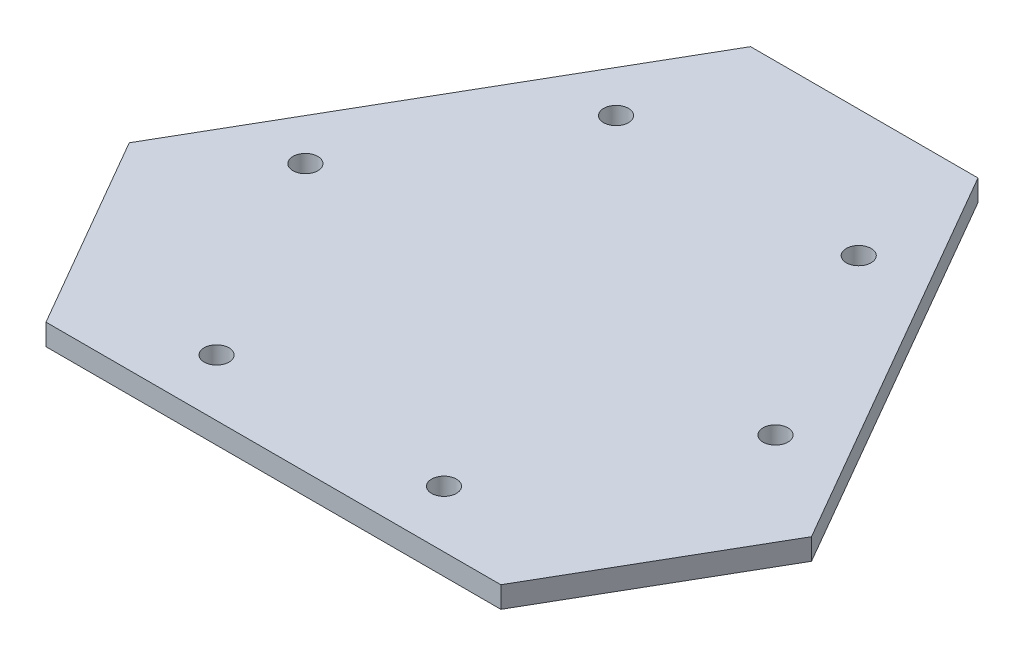
ISO-10303-21;
HEADER;
FILE_DESCRIPTION(('STEP AP214'),'2;1');
FILE_NAME('part.step','',(''),(''),'','','');
FILE_SCHEMA(('AUTOMOTIVE_DESIGN { 1 0 10303 214 1 1 1 1 }'));
ENDSEC;
DATA;
#1=APPLICATION_CONTEXT('core data for automotive mechanical design processes');
#2=APPLICATION_PROTOCOL_DEFINITION('international standard','automotive_design',2000,#1);
#3=PRODUCT_CONTEXT('',#1,'mechanical');
#4=PRODUCT('Part','Part','',(#3));
#5=PRODUCT_RELATED_PRODUCT_CATEGORY('part','',(#4));
#6=PRODUCT_DEFINITION_FORMATION('','',#4);
#7=PRODUCT_DEFINITION_CONTEXT('part definition',#1,'design');
#8=PRODUCT_DEFINITION('design','',#6,#7);
#9=PRODUCT_DEFINITION_SHAPE('','',#8);
#10=(LENGTH_UNIT() NAMED_UNIT(*) SI_UNIT(.MILLI.,.METRE.));
#11=(NAMED_UNIT(*) PLANE_ANGLE_UNIT() SI_UNIT($,.RADIAN.));
#12=(NAMED_UNIT(*) SI_UNIT($,.STERADIAN.) SOLID_ANGLE_UNIT());
#13=UNCERTAINTY_MEASURE_WITH_UNIT(LENGTH_MEASURE(1.E-05),#10,'distance_accuracy_value','');
#14=(GEOMETRIC_REPRESENTATION_CONTEXT(3) GLOBAL_UNCERTAINTY_ASSIGNED_CONTEXT((#13)) GLOBAL_UNIT_ASSIGNED_CONTEXT((#10,
#11,#12)) REPRESENTATION_CONTEXT('',''));
#15=CARTESIAN_POINT('',(0.,0.,0.));
#16=DIRECTION('',(0.,0.,1.));
#17=DIRECTION('',(1.,0.,0.));
#18=AXIS2_PLACEMENT_3D('',#15,#16,#17);
#19=CARTESIAN_POINT('',(-152.4,4.7625,29.329393674833));
#20=DIRECTION('',(0.866025403784438,0.,0.5));
#21=DIRECTION('',(0.5,0.,-0.866025403784439));
#22=AXIS2_PLACEMENT_3D('',#19,#20,#21);
#23=PLANE('',#22);
#24=DIRECTION('',(-0.5,0.,0.866025403784438));
#25=VECTOR('',#24,1.);
#26=CARTESIAN_POINT('',(-152.4,-4.7625,29.329393674833));
#27=LINE('',#26,#25);
#28=CARTESIAN_POINT('',(-50.7999999999999,-4.7625,-146.646968374165));
#29=VERTEX_POINT('',#28);
#30=CARTESIAN_POINT('',(-152.4,-4.7625,29.329393674833));
#31=VERTEX_POINT('',#30);
#32=EDGE_CURVE('E115',#29,#31,#27,.T.);
#33=ORIENTED_EDGE('',*,*,#32,.T.);
#34=DIRECTION('',(0.,-1.,0.));
#35=VECTOR('',#34,1.);
#36=CARTESIAN_POINT('',(-152.4,4.7625,29.329393674833));
#37=LINE('',#36,#35);
#38=CARTESIAN_POINT('',(-152.4,4.7625,29.329393674833));
#39=VERTEX_POINT('',#38);
#40=EDGE_CURVE('E11',#39,#31,#37,.T.);
#41=ORIENTED_EDGE('',*,*,#40,.F.);
#42=DIRECTION('',(-0.5,0.,0.866025403784438));
#43=VECTOR('',#42,1.);
#44=CARTESIAN_POINT('',(-152.4,4.7625,29.329393674833));
#45=LINE('',#44,#43);
#46=CARTESIAN_POINT('',(-50.7999999999999,4.7625,-146.646968374165));
#47=VERTEX_POINT('',#46);
#48=EDGE_CURVE('E126',#47,#39,#45,.T.);
#49=ORIENTED_EDGE('',*,*,#48,.F.);
#50=DIRECTION('',(0.,-1.,0.));
#51=VECTOR('',#50,1.);
#52=CARTESIAN_POINT('',(-50.7999999999999,4.7625,-146.646968374165));
#53=LINE('',#52,#51);
#54=EDGE_CURVE('E111',#47,#29,#53,.T.);
#55=ORIENTED_EDGE('',*,*,#54,.T.);
#56=EDGE_LOOP('',(#33,#41,#49,#55));
#57=FACE_BOUND('',#56,.T.);
#58=ADVANCED_FACE('F31',(#57),#23,.F.);
#59=CARTESIAN_POINT('',(-101.6,4.7625,117.317574699332));
#60=DIRECTION('',(0.866025403784439,0.,-0.5));
#61=DIRECTION('',(-0.5,0.,-0.866025403784439));
#62=AXIS2_PLACEMENT_3D('',#59,#60,#61);
#63=PLANE('',#62);
#64=DIRECTION('',(0.5,0.,0.866025403784439));
#65=VECTOR('',#64,1.);
#66=CARTESIAN_POINT('',(-101.6,-4.7625,117.317574699332));
#67=LINE('',#66,#65);
#68=CARTESIAN_POINT('',(-101.6,-4.7625,117.317574699332));
#69=VERTEX_POINT('',#68);
#70=EDGE_CURVE('E118',#31,#69,#67,.T.);
#71=ORIENTED_EDGE('',*,*,#70,.T.);
#72=DIRECTION('',(0.,-1.,0.));
#73=VECTOR('',#72,1.);
#74=CARTESIAN_POINT('',(-101.6,4.7625,117.317574699332));
#75=LINE('',#74,#73);
#76=CARTESIAN_POINT('',(-101.6,4.7625,117.317574699332));
#77=VERTEX_POINT('',#76);
#78=EDGE_CURVE('E39',#77,#69,#75,.T.);
#79=ORIENTED_EDGE('',*,*,#78,.F.);
#80=DIRECTION('',(0.5,0.,0.866025403784439));
#81=VECTOR('',#80,1.);
#82=CARTESIAN_POINT('',(-101.6,4.7625,117.317574699332));
#83=LINE('',#82,#81);
#84=EDGE_CURVE('E84',#39,#77,#83,.T.);
#85=ORIENTED_EDGE('',*,*,#84,.F.);
#86=ORIENTED_EDGE('',*,*,#40,.T.);
#87=EDGE_LOOP('',(#71,#79,#85,#86));
#88=FACE_BOUND('',#87,.T.);
#89=ADVANCED_FACE('F151',(#88),#63,.F.);
#90=CARTESIAN_POINT('',(101.6,4.7625,117.317574699332));
#91=DIRECTION('',(0.,0.,-1.));
#92=DIRECTION('',(-1.,0.,0.));
#93=AXIS2_PLACEMENT_3D('',#90,#91,#92);
#94=PLANE('',#93);
#95=DIRECTION('',(1.,0.,0.));
#96=VECTOR('',#95,1.);
#97=CARTESIAN_POINT('',(101.6,-4.7625,117.317574699332));
#98=LINE('',#97,#96);
#99=CARTESIAN_POINT('',(101.6,-4.7625,117.317574699332));
#100=VERTEX_POINT('',#99);
#101=EDGE_CURVE('E121',#69,#100,#98,.T.);
#102=ORIENTED_EDGE('',*,*,#101,.T.);
#103=DIRECTION('',(0.,-1.,0.));
#104=VECTOR('',#103,1.);
#105=CARTESIAN_POINT('',(101.6,4.7625,117.317574699332));
#106=LINE('',#105,#104);
#107=CARTESIAN_POINT('',(101.6,4.7625,117.317574699332));
#108=VERTEX_POINT('',#107);
#109=EDGE_CURVE('E106',#108,#100,#106,.T.);
#110=ORIENTED_EDGE('',*,*,#109,.F.);
#111=DIRECTION('',(1.,0.,0.));
#112=VECTOR('',#111,1.);
#113=CARTESIAN_POINT('',(101.6,4.7625,117.317574699332));
#114=LINE('',#113,#112);
#115=EDGE_CURVE('E97',#77,#108,#114,.T.);
#116=ORIENTED_EDGE('',*,*,#115,.F.);
#117=ORIENTED_EDGE('',*,*,#78,.T.);
#118=EDGE_LOOP('',(#102,#110,#116,#117));
#119=FACE_BOUND('',#118,.T.);
#120=ADVANCED_FACE('F132',(#119),#94,.F.);
#121=CARTESIAN_POINT('',(152.4,4.7625,29.329393674833));
#122=DIRECTION('',(-0.866025403784438,0.,-0.5));
#123=DIRECTION('',(-0.5,0.,0.866025403784438));
#124=AXIS2_PLACEMENT_3D('',#121,#122,#123);
#125=PLANE('',#124);
#126=DIRECTION('',(0.5,0.,-0.866025403784438));
#127=VECTOR('',#126,1.);
#128=CARTESIAN_POINT('',(152.4,-4.7625,29.329393674833));
#129=LINE('',#128,#127);
#130=CARTESIAN_POINT('',(152.4,-4.7625,29.329393674833));
#131=VERTEX_POINT('',#130);
#132=EDGE_CURVE('E105',#100,#131,#129,.T.);
#133=ORIENTED_EDGE('',*,*,#132,.T.);
#134=DIRECTION('',(0.,-1.,0.));
#135=VECTOR('',#134,1.);
#136=CARTESIAN_POINT('',(152.4,4.7625,29.329393674833));
#137=LINE('',#136,#135);
#138=CARTESIAN_POINT('',(152.4,4.7625,29.329393674833));
#139=VERTEX_POINT('',#138);
#140=EDGE_CURVE('E102',#139,#131,#137,.T.);
#141=ORIENTED_EDGE('',*,*,#140,.F.);
#142=DIRECTION('',(0.5,0.,-0.866025403784438));
#143=VECTOR('',#142,1.);
#144=CARTESIAN_POINT('',(152.4,4.7625,29.329393674833));
#145=LINE('',#144,#143);
#146=EDGE_CURVE('E91',#108,#139,#145,.T.);
#147=ORIENTED_EDGE('',*,*,#146,.F.);
#148=ORIENTED_EDGE('',*,*,#109,.T.);
#149=EDGE_LOOP('',(#133,#141,#147,#148));
#150=FACE_BOUND('',#149,.T.);
#151=ADVANCED_FACE('F103',(#150),#125,.F.);
#152=CARTESIAN_POINT('',(50.8000000000001,4.7625,-146.646968374165));
#153=DIRECTION('',(-0.866025403784439,0.,0.5));
#154=DIRECTION('',(0.5,0.,0.866025403784439));
#155=AXIS2_PLACEMENT_3D('',#152,#153,#154);
#156=PLANE('',#155);
#157=DIRECTION('',(-0.5,0.,-0.866025403784439));
#158=VECTOR('',#157,1.);
#159=CARTESIAN_POINT('',(50.8000000000001,-4.7625,-146.646968374165));
#160=LINE('',#159,#158);
#161=CARTESIAN_POINT('',(50.8000000000001,-4.7625,-146.646968374165));
#162=VERTEX_POINT('',#161);
#163=EDGE_CURVE('E70',#131,#162,#160,.T.);
#164=ORIENTED_EDGE('',*,*,#163,.T.);
#165=DIRECTION('',(0.,-1.,0.));
#166=VECTOR('',#165,1.);
#167=CARTESIAN_POINT('',(50.8000000000001,4.7625,-146.646968374165));
#168=LINE('',#167,#166);
#169=CARTESIAN_POINT('',(50.8000000000001,4.7625,-146.646968374165));
#170=VERTEX_POINT('',#169);
#171=EDGE_CURVE('E107',#170,#162,#168,.T.);
#172=ORIENTED_EDGE('',*,*,#171,.F.);
#173=DIRECTION('',(-0.5,0.,-0.866025403784439));
#174=VECTOR('',#173,1.);
#175=CARTESIAN_POINT('',(50.8000000000001,4.7625,-146.646968374165));
#176=LINE('',#175,#174);
#177=EDGE_CURVE('E95',#139,#170,#176,.T.);
#178=ORIENTED_EDGE('',*,*,#177,.F.);
#179=ORIENTED_EDGE('',*,*,#140,.T.);
#180=EDGE_LOOP('',(#164,#172,#178,#179));
#181=FACE_BOUND('',#180,.T.);
#182=ADVANCED_FACE('F109',(#181),#156,.F.);
#183=CARTESIAN_POINT('',(-50.7999999999999,4.7625,-146.646968374165));
#184=DIRECTION('',(0.,0.,1.));
#185=DIRECTION('',(1.,0.,0.));
#186=AXIS2_PLACEMENT_3D('',#183,#184,#185);
#187=PLANE('',#186);
#188=DIRECTION('',(-1.,0.,0.));
#189=VECTOR('',#188,1.);
#190=CARTESIAN_POINT('',(-50.7999999999999,-4.7625,-146.646968374165));
#191=LINE('',#190,#189);
#192=EDGE_CURVE('E76',#162,#29,#191,.T.);
#193=ORIENTED_EDGE('',*,*,#192,.T.);
#194=ORIENTED_EDGE('',*,*,#54,.F.);
#195=DIRECTION('',(-1.,0.,0.));
#196=VECTOR('',#195,1.);
#197=CARTESIAN_POINT('',(-50.7999999999999,4.7625,-146.646968374165));
#198=LINE('',#197,#196);
#199=EDGE_CURVE('E47',#170,#47,#198,.T.);
#200=ORIENTED_EDGE('',*,*,#199,.F.);
#201=ORIENTED_EDGE('',*,*,#171,.T.);
#202=EDGE_LOOP('',(#193,#194,#200,#201));
#203=FACE_BOUND('',#202,.T.);
#204=ADVANCED_FACE('F139',(#203),#187,.F.);
#205=CARTESIAN_POINT('',(-50.7999999999999,4.7625,-146.646968374165));
#206=DIRECTION('',(0.,-1.,0.));
#207=DIRECTION('',(0.,0.,-1.));
#208=AXIS2_PLACEMENT_3D('',#205,#206,#207);
#209=PLANE('',#208);
#210=CARTESIAN_POINT('',(-105.002954743875,4.7625,-1.9646968374175));
#211=DIRECTION('',(0.,1.,0.));
#212=DIRECTION('',(0.866025403784443,0.,-0.499999999999992));
#213=AXIS2_PLACEMENT_3D('',#210,#211,#212);
#214=CIRCLE('',#213,5.55625);
#215=CARTESIAN_POINT('',(-100.191101094098,4.7625,-4.74282183741745));
#216=VERTEX_POINT('',#215);
#217=EDGE_CURVE('E257',#216,#216,#214,.T.);
#218=ORIENTED_EDGE('',*,*,#217,.F.);
#219=EDGE_LOOP('',(#218));
#220=FACE_BOUND('',#219,.T.);
#221=CARTESIAN_POINT('',(-54.2029547438744,4.7625,-89.952877861916));
#222=DIRECTION('',(0.,1.,0.));
#223=DIRECTION('',(0.866025403784443,0.,-0.499999999999992));
#224=AXIS2_PLACEMENT_3D('',#221,#222,#223);
#225=CIRCLE('',#224,5.55625);
#226=CARTESIAN_POINT('',(-49.3911010940971,4.7625,-92.7310028619159));
#227=VERTEX_POINT('',#226);
#228=EDGE_CURVE('E259',#227,#227,#225,.T.);
#229=ORIENTED_EDGE('',*,*,#228,.F.);
#230=EDGE_LOOP('',(#229));
#231=FACE_BOUND('',#230,.T.);
#232=CARTESIAN_POINT('',(50.7999999999995,4.7625,91.9175746993322));
#233=DIRECTION('',(0.,1.,0.));
#234=DIRECTION('',(-0.866025403784436,0.,-0.500000000000004));
#235=AXIS2_PLACEMENT_3D('',#232,#233,#234);
#236=CIRCLE('',#235,5.55625);
#237=CARTESIAN_POINT('',(45.9881463502223,4.7625,89.1394496993322));
#238=VERTEX_POINT('',#237);
#239=EDGE_CURVE('E265',#238,#238,#236,.T.);
#240=ORIENTED_EDGE('',*,*,#239,.F.);
#241=EDGE_LOOP('',(#240));
#242=FACE_BOUND('',#241,.T.);
#243=CARTESIAN_POINT('',(-50.8000000000004,4.7625,91.9175746993318));
#244=DIRECTION('',(0.,1.,0.));
#245=DIRECTION('',(-0.866025403784436,0.,-0.500000000000004));
#246=AXIS2_PLACEMENT_3D('',#243,#244,#245);
#247=CIRCLE('',#246,5.55625);
#248=CARTESIAN_POINT('',(-55.6118536497777,4.7625,89.1394496993317));
#249=VERTEX_POINT('',#248);
#250=EDGE_CURVE('E271',#249,#249,#247,.T.);
#251=ORIENTED_EDGE('',*,*,#250,.F.);
#252=EDGE_LOOP('',(#251));
#253=FACE_BOUND('',#252,.T.);
#254=CARTESIAN_POINT('',(54.2029547438753,4.7625,-89.9528778619154));
#255=DIRECTION('',(0.,1.,0.));
#256=DIRECTION('',(0.,0.,1.));
#257=AXIS2_PLACEMENT_3D('',#254,#255,#256);
#258=CIRCLE('',#257,5.55625);
#259=CARTESIAN_POINT('',(54.2029547438753,4.7625,-84.3966278619154));
#260=VERTEX_POINT('',#259);
#261=EDGE_CURVE('E277',#260,#260,#258,.T.);
#262=ORIENTED_EDGE('',*,*,#261,.F.);
#263=EDGE_LOOP('',(#262));
#264=FACE_BOUND('',#263,.T.);
#265=CARTESIAN_POINT('',(105.002954743875,4.7625,-1.9646968374165));
#266=DIRECTION('',(0.,1.,0.));
#267=DIRECTION('',(0.,0.,1.));
#268=AXIS2_PLACEMENT_3D('',#265,#266,#267);
#269=CIRCLE('',#268,5.55625);
#270=CARTESIAN_POINT('',(105.002954743875,4.7625,3.5915531625835));
#271=VERTEX_POINT('',#270);
#272=EDGE_CURVE('E283',#271,#271,#269,.T.);
#273=ORIENTED_EDGE('',*,*,#272,.F.);
#274=EDGE_LOOP('',(#273));
#275=FACE_BOUND('',#274,.T.);
#276=ORIENTED_EDGE('',*,*,#48,.T.);
#277=ORIENTED_EDGE('',*,*,#84,.T.);
#278=ORIENTED_EDGE('',*,*,#115,.T.);
#279=ORIENTED_EDGE('',*,*,#146,.T.);
#280=ORIENTED_EDGE('',*,*,#177,.T.);
#281=ORIENTED_EDGE('',*,*,#199,.T.);
#282=EDGE_LOOP('',(#276,#277,#278,#279,#280,#281));
#283=FACE_BOUND('',#282,.T.);
#284=ADVANCED_FACE('F93',(#220,#231,#242,#253,#264,#275,#283),#209,.F.);
#285=CARTESIAN_POINT('',(-50.7999999999999,-4.7625,-146.646968374165));
#286=DIRECTION('',(0.,-1.,0.));
#287=DIRECTION('',(0.,0.,-1.));
#288=AXIS2_PLACEMENT_3D('',#285,#286,#287);
#289=PLANE('',#288);
#290=CARTESIAN_POINT('',(-105.002954743875,-4.7625,-1.9646968374175));
#291=DIRECTION('',(0.,1.,0.));
#292=DIRECTION('',(0.866025403784443,0.,-0.499999999999992));
#293=AXIS2_PLACEMENT_3D('',#290,#291,#292);
#294=CIRCLE('',#293,5.55625);
#295=CARTESIAN_POINT('',(-100.191101094098,-4.7625,-4.74282183741745));
#296=VERTEX_POINT('',#295);
#297=EDGE_CURVE('E254',#296,#296,#294,.T.);
#298=ORIENTED_EDGE('',*,*,#297,.T.);
#299=EDGE_LOOP('',(#298));
#300=FACE_BOUND('',#299,.T.);
#301=CARTESIAN_POINT('',(-54.2029547438744,-4.7625,-89.952877861916));
#302=DIRECTION('',(0.,1.,0.));
#303=DIRECTION('',(0.866025403784443,0.,-0.499999999999992));
#304=AXIS2_PLACEMENT_3D('',#301,#302,#303);
#305=CIRCLE('',#304,5.55625);
#306=CARTESIAN_POINT('',(-49.3911010940971,-4.7625,-92.7310028619159));
#307=VERTEX_POINT('',#306);
#308=EDGE_CURVE('E262',#307,#307,#305,.T.);
#309=ORIENTED_EDGE('',*,*,#308,.T.);
#310=EDGE_LOOP('',(#309));
#311=FACE_BOUND('',#310,.T.);
#312=CARTESIAN_POINT('',(50.7999999999995,-4.7625,91.9175746993322));
#313=DIRECTION('',(0.,1.,0.));
#314=DIRECTION('',(-0.866025403784436,0.,-0.500000000000004));
#315=AXIS2_PLACEMENT_3D('',#312,#313,#314);
#316=CIRCLE('',#315,5.55625);
#317=CARTESIAN_POINT('',(45.9881463502223,-4.7625,89.1394496993322));
#318=VERTEX_POINT('',#317);
#319=EDGE_CURVE('E268',#318,#318,#316,.T.);
#320=ORIENTED_EDGE('',*,*,#319,.T.);
#321=EDGE_LOOP('',(#320));
#322=FACE_BOUND('',#321,.T.);
#323=CARTESIAN_POINT('',(-50.8000000000004,-4.7625,91.9175746993318));
#324=DIRECTION('',(0.,1.,0.));
#325=DIRECTION('',(-0.866025403784436,0.,-0.500000000000004));
#326=AXIS2_PLACEMENT_3D('',#323,#324,#325);
#327=CIRCLE('',#326,5.55625);
#328=CARTESIAN_POINT('',(-55.6118536497777,-4.7625,89.1394496993317));
#329=VERTEX_POINT('',#328);
#330=EDGE_CURVE('E274',#329,#329,#327,.T.);
#331=ORIENTED_EDGE('',*,*,#330,.T.);
#332=EDGE_LOOP('',(#331));
#333=FACE_BOUND('',#332,.T.);
#334=CARTESIAN_POINT('',(54.2029547438753,-4.7625,-89.9528778619154));
#335=DIRECTION('',(0.,1.,0.));
#336=DIRECTION('',(0.,0.,1.));
#337=AXIS2_PLACEMENT_3D('',#334,#335,#336);
#338=CIRCLE('',#337,5.55625);
#339=CARTESIAN_POINT('',(54.2029547438753,-4.7625,-84.3966278619154));
#340=VERTEX_POINT('',#339);
#341=EDGE_CURVE('E280',#340,#340,#338,.T.);
#342=ORIENTED_EDGE('',*,*,#341,.T.);
#343=EDGE_LOOP('',(#342));
#344=FACE_BOUND('',#343,.T.);
#345=CARTESIAN_POINT('',(105.002954743875,-4.7625,-1.9646968374165));
#346=DIRECTION('',(0.,1.,0.));
#347=DIRECTION('',(0.,0.,1.));
#348=AXIS2_PLACEMENT_3D('',#345,#346,#347);
#349=CIRCLE('',#348,5.55625);
#350=CARTESIAN_POINT('',(105.002954743875,-4.7625,3.5915531625835));
#351=VERTEX_POINT('',#350);
#352=EDGE_CURVE('E119',#351,#351,#349,.T.);
#353=ORIENTED_EDGE('',*,*,#352,.T.);
#354=EDGE_LOOP('',(#353));
#355=FACE_BOUND('',#354,.T.);
#356=ORIENTED_EDGE('',*,*,#32,.F.);
#357=ORIENTED_EDGE('',*,*,#192,.F.);
#358=ORIENTED_EDGE('',*,*,#163,.F.);
#359=ORIENTED_EDGE('',*,*,#132,.F.);
#360=ORIENTED_EDGE('',*,*,#101,.F.);
#361=ORIENTED_EDGE('',*,*,#70,.F.);
#362=EDGE_LOOP('',(#356,#357,#358,#359,#360,#361));
#363=FACE_BOUND('',#362,.T.);
#364=ADVANCED_FACE('F135',(#300,#311,#322,#333,#344,#355,#363),#289,.T.);
#365=CARTESIAN_POINT('',(105.002954743875,-4.7625,-1.9646968374165));
#366=DIRECTION('',(0.,1.,0.));
#367=DIRECTION('',(0.,0.,1.));
#368=AXIS2_PLACEMENT_3D('',#365,#366,#367);
#369=CYLINDRICAL_SURFACE('',#368,5.55625);
#370=ORIENTED_EDGE('',*,*,#352,.F.);
#371=EDGE_LOOP('',(#370));
#372=FACE_BOUND('',#371,.T.);
#373=ORIENTED_EDGE('',*,*,#272,.T.);
#374=EDGE_LOOP('',(#373));
#375=FACE_BOUND('',#374,.T.);
#376=ADVANCED_FACE('F179',(#372,#375),#369,.F.);
#377=CARTESIAN_POINT('',(54.2029547438753,-4.7625,-89.9528778619154));
#378=DIRECTION('',(0.,1.,0.));
#379=DIRECTION('',(0.,0.,1.));
#380=AXIS2_PLACEMENT_3D('',#377,#378,#379);
#381=CYLINDRICAL_SURFACE('',#380,5.55625);
#382=ORIENTED_EDGE('',*,*,#341,.F.);
#383=EDGE_LOOP('',(#382));
#384=FACE_BOUND('',#383,.T.);
#385=ORIENTED_EDGE('',*,*,#261,.T.);
#386=EDGE_LOOP('',(#385));
#387=FACE_BOUND('',#386,.T.);
#388=ADVANCED_FACE('F184',(#384,#387),#381,.F.);
#389=CARTESIAN_POINT('',(-50.8000000000004,-4.7625,91.9175746993318));
#390=DIRECTION('',(0.,1.,0.));
#391=DIRECTION('',(0.,0.,1.));
#392=AXIS2_PLACEMENT_3D('',#389,#390,#391);
#393=CYLINDRICAL_SURFACE('',#392,5.55625);
#394=ORIENTED_EDGE('',*,*,#330,.F.);
#395=EDGE_LOOP('',(#394));
#396=FACE_BOUND('',#395,.T.);
#397=ORIENTED_EDGE('',*,*,#250,.T.);
#398=EDGE_LOOP('',(#397));
#399=FACE_BOUND('',#398,.T.);
#400=ADVANCED_FACE('F196',(#396,#399),#393,.F.);
#401=CARTESIAN_POINT('',(50.7999999999995,-4.7625,91.9175746993322));
#402=DIRECTION('',(0.,1.,0.));
#403=DIRECTION('',(0.,0.,1.));
#404=AXIS2_PLACEMENT_3D('',#401,#402,#403);
#405=CYLINDRICAL_SURFACE('',#404,5.55625);
#406=ORIENTED_EDGE('',*,*,#319,.F.);
#407=EDGE_LOOP('',(#406));
#408=FACE_BOUND('',#407,.T.);
#409=ORIENTED_EDGE('',*,*,#239,.T.);
#410=EDGE_LOOP('',(#409));
#411=FACE_BOUND('',#410,.T.);
#412=ADVANCED_FACE('F217',(#408,#411),#405,.F.);
#413=CARTESIAN_POINT('',(-54.2029547438744,-4.7625,-89.952877861916));
#414=DIRECTION('',(0.,1.,0.));
#415=DIRECTION('',(0.,0.,1.));
#416=AXIS2_PLACEMENT_3D('',#413,#414,#415);
#417=CYLINDRICAL_SURFACE('',#416,5.55625);
#418=ORIENTED_EDGE('',*,*,#308,.F.);
#419=EDGE_LOOP('',(#418));
#420=FACE_BOUND('',#419,.T.);
#421=ORIENTED_EDGE('',*,*,#228,.T.);
#422=EDGE_LOOP('',(#421));
#423=FACE_BOUND('',#422,.T.);
#424=ADVANCED_FACE('F227',(#420,#423),#417,.F.);
#425=CARTESIAN_POINT('',(-105.002954743875,-4.7625,-1.9646968374175));
#426=DIRECTION('',(0.,1.,0.));
#427=DIRECTION('',(0.,0.,1.));
#428=AXIS2_PLACEMENT_3D('',#425,#426,#427);
#429=CYLINDRICAL_SURFACE('',#428,5.55625);
#430=ORIENTED_EDGE('',*,*,#297,.F.);
#431=EDGE_LOOP('',(#430));
#432=FACE_BOUND('',#431,.T.);
#433=ORIENTED_EDGE('',*,*,#217,.T.);
#434=EDGE_LOOP('',(#433));
#435=FACE_BOUND('',#434,.T.);
#436=ADVANCED_FACE('F237',(#432,#435),#429,.F.);
#437=CLOSED_SHELL('',(#58,#89,#120,#151,#182,#204,#284,#364,#376,#388,#400,#412,#424,#436));
#438=MANIFOLD_SOLID_BREP('B2',#437);
#439=ADVANCED_BREP_SHAPE_REPRESENTATION('',(#18,#438),#14);
#440=SHAPE_DEFINITION_REPRESENTATION(#9,#439);
ENDSEC;
END-ISO-10303-21;
